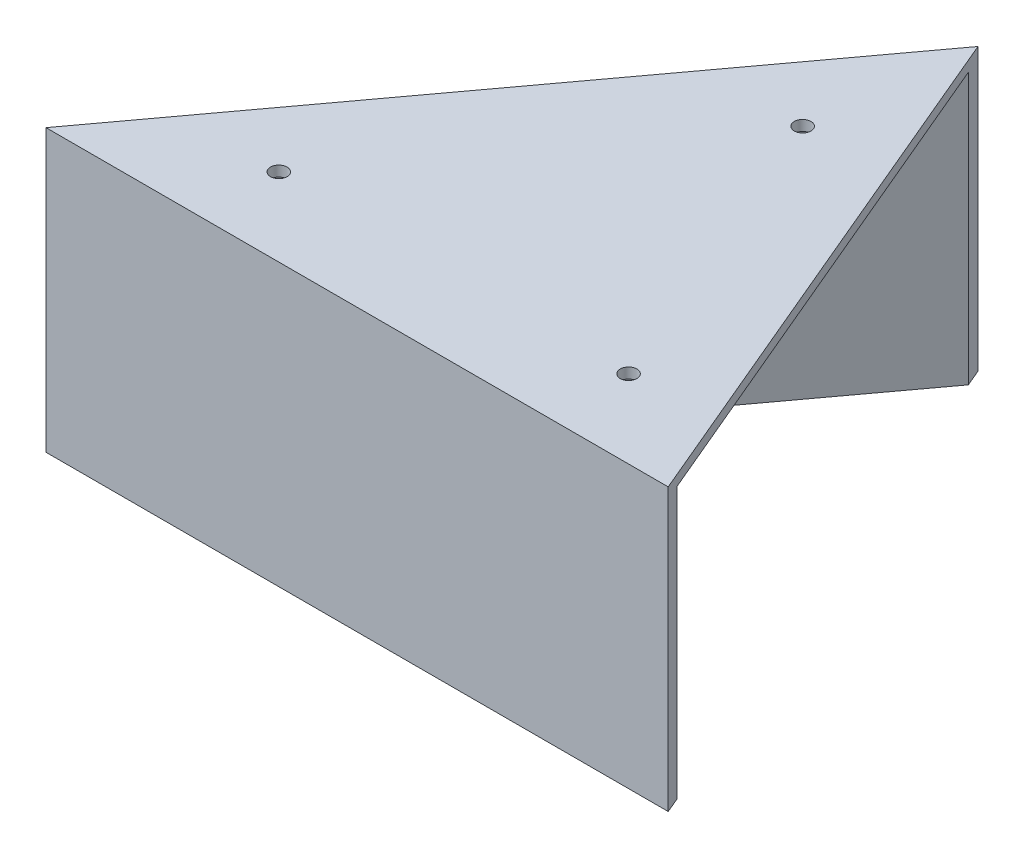
ISO-10303-21;
HEADER;
FILE_DESCRIPTION(('STEP AP214'),'2;1');
FILE_NAME('part.step','',(''),(''),'','','');
FILE_SCHEMA(('AUTOMOTIVE_DESIGN { 1 0 10303 214 1 1 1 1 }'));
ENDSEC;
DATA;
#1=APPLICATION_CONTEXT('core data for automotive mechanical design processes');
#2=APPLICATION_PROTOCOL_DEFINITION('international standard','automotive_design',2000,#1);
#3=PRODUCT_CONTEXT('',#1,'mechanical');
#4=PRODUCT('Part','Part','',(#3));
#5=PRODUCT_RELATED_PRODUCT_CATEGORY('part','',(#4));
#6=PRODUCT_DEFINITION_FORMATION('','',#4);
#7=PRODUCT_DEFINITION_CONTEXT('part definition',#1,'design');
#8=PRODUCT_DEFINITION('design','',#6,#7);
#9=PRODUCT_DEFINITION_SHAPE('','',#8);
#10=(LENGTH_UNIT() NAMED_UNIT(*) SI_UNIT(.MILLI.,.METRE.));
#11=(NAMED_UNIT(*) PLANE_ANGLE_UNIT() SI_UNIT($,.RADIAN.));
#12=(NAMED_UNIT(*) SI_UNIT($,.STERADIAN.) SOLID_ANGLE_UNIT());
#13=UNCERTAINTY_MEASURE_WITH_UNIT(LENGTH_MEASURE(1.E-05),#10,'distance_accuracy_value','');
#14=(GEOMETRIC_REPRESENTATION_CONTEXT(3) GLOBAL_UNCERTAINTY_ASSIGNED_CONTEXT((#13)) GLOBAL_UNIT_ASSIGNED_CONTEXT((#10,
#11,#12)) REPRESENTATION_CONTEXT('',''));
#15=CARTESIAN_POINT('',(0.,0.,0.));
#16=DIRECTION('',(0.,0.,1.));
#17=DIRECTION('',(1.,0.,0.));
#18=AXIS2_PLACEMENT_3D('',#15,#16,#17);
#19=CARTESIAN_POINT('',(6.5,2.,-103.));
#20=DIRECTION('',(-0.921213947184014,0.,0.389056375752472));
#21=DIRECTION('',(0.389056375752472,0.,0.921213947184014));
#22=AXIS2_PLACEMENT_3D('',#19,#20,#21);
#23=PLANE('',#22);
#24=DIRECTION('',(0.389056375752472,0.,0.921213947184014));
#25=VECTOR('',#24,1.);
#26=CARTESIAN_POINT('',(6.5,-52.,-103.));
#27=LINE('',#26,#25);
#28=CARTESIAN_POINT('',(48.7330097087379,-52.,-3.00000000000003));
#29=VERTEX_POINT('',#28);
#30=CARTESIAN_POINT('',(50.,-52.,0.));
#31=VERTEX_POINT('',#30);
#32=EDGE_CURVE('E89',#29,#31,#27,.T.);
#33=ORIENTED_EDGE('',*,*,#32,.F.);
#34=DIRECTION('',(0.,-1.,0.));
#35=VECTOR('',#34,1.);
#36=CARTESIAN_POINT('',(48.7330097087379,113.00308109224,-3.00000000000003));
#37=LINE('',#36,#35);
#38=CARTESIAN_POINT('',(48.7330097087379,0.,-3.00000000000003));
#39=VERTEX_POINT('',#38);
#40=EDGE_CURVE('E98',#39,#29,#37,.T.);
#41=ORIENTED_EDGE('',*,*,#40,.F.);
#42=DIRECTION('',(0.389056375752472,0.,0.921213947184014));
#43=VECTOR('',#42,1.);
#44=CARTESIAN_POINT('',(6.5,0.,-103.));
#45=LINE('',#44,#43);
#46=CARTESIAN_POINT('',(7.85715235470177,0.,-99.7865128153038));
#47=VERTEX_POINT('',#46);
#48=EDGE_CURVE('E102',#47,#39,#45,.T.);
#49=ORIENTED_EDGE('',*,*,#48,.F.);
#50=DIRECTION('',(0.,-1.,0.));
#51=VECTOR('',#50,1.);
#52=CARTESIAN_POINT('',(7.85715235470177,2.,-99.7865128153038));
#53=LINE('',#52,#51);
#54=CARTESIAN_POINT('',(7.8571523547018,-52.,-99.7865128153039));
#55=VERTEX_POINT('',#54);
#56=EDGE_CURVE('E131',#47,#55,#53,.T.);
#57=ORIENTED_EDGE('',*,*,#56,.T.);
#58=CARTESIAN_POINT('',(6.5,-52.,-103.));
#59=VERTEX_POINT('',#58);
#60=EDGE_CURVE('E106',#59,#55,#27,.T.);
#61=ORIENTED_EDGE('',*,*,#60,.F.);
#62=DIRECTION('',(0.,-1.,0.));
#63=VECTOR('',#62,1.);
#64=CARTESIAN_POINT('',(6.5,2.,-103.));
#65=LINE('',#64,#63);
#66=CARTESIAN_POINT('',(6.5,2.,-103.));
#67=VERTEX_POINT('',#66);
#68=EDGE_CURVE('E40',#67,#59,#65,.T.);
#69=ORIENTED_EDGE('',*,*,#68,.F.);
#70=DIRECTION('',(-0.389056375752472,0.,-0.921213947184014));
#71=VECTOR('',#70,1.);
#72=CARTESIAN_POINT('',(6.5,2.,-103.));
#73=LINE('',#72,#71);
#74=CARTESIAN_POINT('',(50.,2.,0.));
#75=VERTEX_POINT('',#74);
#76=EDGE_CURVE('E117',#75,#67,#73,.T.);
#77=ORIENTED_EDGE('',*,*,#76,.F.);
#78=DIRECTION('',(0.,-1.,0.));
#79=VECTOR('',#78,1.);
#80=CARTESIAN_POINT('',(50.,2.,0.));
#81=LINE('',#80,#79);
#82=EDGE_CURVE('E11',#75,#31,#81,.T.);
#83=ORIENTED_EDGE('',*,*,#82,.T.);
#84=EDGE_LOOP('',(#33,#41,#49,#57,#61,#69,#77,#83));
#85=FACE_BOUND('',#84,.T.);
#86=ADVANCED_FACE('F33',(#85),#23,.F.);
#87=CARTESIAN_POINT('',(6.5,2.,-103.));
#88=DIRECTION('',(0.804662944010431,0.,0.593731881017405));
#89=DIRECTION('',(0.593731881017405,0.,-0.804662944010431));
#90=AXIS2_PLACEMENT_3D('',#87,#88,#89);
#91=PLANE('',#90);
#92=ORIENTED_EDGE('',*,*,#68,.T.);
#93=DIRECTION('',(0.593731881017405,0.,-0.804662944010431));
#94=VECTOR('',#93,1.);
#95=CARTESIAN_POINT('',(-69.5,-52.,0.));
#96=LINE('',#95,#94);
#97=CARTESIAN_POINT('',(-69.5,-52.,0.));
#98=VERTEX_POINT('',#97);
#99=EDGE_CURVE('E113',#98,#59,#96,.T.);
#100=ORIENTED_EDGE('',*,*,#99,.F.);
#101=DIRECTION('',(0.,-1.,0.));
#102=VECTOR('',#101,1.);
#103=CARTESIAN_POINT('',(-69.5,2.,0.));
#104=LINE('',#103,#102);
#105=CARTESIAN_POINT('',(-69.5,2.,0.));
#106=VERTEX_POINT('',#105);
#107=EDGE_CURVE('E121',#106,#98,#104,.T.);
#108=ORIENTED_EDGE('',*,*,#107,.F.);
#109=DIRECTION('',(-0.593731881017405,0.,0.804662944010431));
#110=VECTOR('',#109,1.);
#111=CARTESIAN_POINT('',(6.5,2.,-103.));
#112=LINE('',#111,#110);
#113=EDGE_CURVE('E119',#67,#106,#112,.T.);
#114=ORIENTED_EDGE('',*,*,#113,.F.);
#115=EDGE_LOOP('',(#92,#100,#108,#114));
#116=FACE_BOUND('',#115,.T.);
#117=ADVANCED_FACE('F126',(#116),#91,.F.);
#118=CARTESIAN_POINT('',(0.,2.,0.));
#119=DIRECTION('',(0.,0.,-1.));
#120=DIRECTION('',(-1.,0.,0.));
#121=AXIS2_PLACEMENT_3D('',#118,#119,#120);
#122=PLANE('',#121);
#123=ORIENTED_EDGE('',*,*,#107,.T.);
#124=DIRECTION('',(-1.,0.,0.));
#125=VECTOR('',#124,1.);
#126=CARTESIAN_POINT('',(50.,-52.,0.));
#127=LINE('',#126,#125);
#128=EDGE_CURVE('E108',#31,#98,#127,.T.);
#129=ORIENTED_EDGE('',*,*,#128,.F.);
#130=ORIENTED_EDGE('',*,*,#82,.F.);
#131=DIRECTION('',(1.,0.,0.));
#132=VECTOR('',#131,1.);
#133=CARTESIAN_POINT('',(0.,2.,0.));
#134=LINE('',#133,#132);
#135=EDGE_CURVE('E55',#106,#75,#134,.T.);
#136=ORIENTED_EDGE('',*,*,#135,.F.);
#137=EDGE_LOOP('',(#123,#129,#130,#136));
#138=FACE_BOUND('',#137,.T.);
#139=ADVANCED_FACE('F171',(#138),#122,.F.);
#140=CARTESIAN_POINT('',(0.,2.,0.));
#141=DIRECTION('',(0.,-1.,0.));
#142=DIRECTION('',(0.,0.,-1.));
#143=AXIS2_PLACEMENT_3D('',#140,#141,#142);
#144=PLANE('',#143);
#145=CARTESIAN_POINT('',(-39.7906932732431,2.,-15.));
#146=DIRECTION('',(0.,-1.,0.));
#147=DIRECTION('',(0.,0.,-1.));
#148=AXIS2_PLACEMENT_3D('',#145,#146,#147);
#149=CIRCLE('',#148,1.6);
#150=CARTESIAN_POINT('',(-39.7906932732431,2.,-16.6));
#151=VERTEX_POINT('',#150);
#152=EDGE_CURVE('E151',#151,#151,#149,.T.);
#153=ORIENTED_EDGE('',*,*,#152,.T.);
#154=EDGE_LOOP('',(#153));
#155=FACE_BOUND('',#154,.T.);
#156=CARTESIAN_POINT('',(27.382186081769,2.,-15.));
#157=DIRECTION('',(0.,-1.,0.));
#158=DIRECTION('',(0.,0.,-1.));
#159=AXIS2_PLACEMENT_3D('',#156,#157,#158);
#160=CIRCLE('',#159,1.6);
#161=CARTESIAN_POINT('',(27.382186081769,2.,-16.6));
#162=VERTEX_POINT('',#161);
#163=EDGE_CURVE('E148',#162,#162,#160,.T.);
#164=ORIENTED_EDGE('',*,*,#163,.T.);
#165=EDGE_LOOP('',(#164));
#166=FACE_BOUND('',#165,.T.);
#167=CARTESIAN_POINT('',(2.93013376425414,2.,-72.8979629587134));
#168=DIRECTION('',(0.,-1.,0.));
#169=DIRECTION('',(0.,0.,-1.));
#170=AXIS2_PLACEMENT_3D('',#167,#168,#169);
#171=CIRCLE('',#170,1.6);
#172=CARTESIAN_POINT('',(2.93013376425414,2.,-74.4979629587134));
#173=VERTEX_POINT('',#172);
#174=EDGE_CURVE('E143',#173,#173,#171,.T.);
#175=ORIENTED_EDGE('',*,*,#174,.T.);
#176=EDGE_LOOP('',(#175));
#177=FACE_BOUND('',#176,.T.);
#178=ORIENTED_EDGE('',*,*,#135,.T.);
#179=ORIENTED_EDGE('',*,*,#76,.T.);
#180=ORIENTED_EDGE('',*,*,#113,.T.);
#181=EDGE_LOOP('',(#178,#179,#180));
#182=FACE_BOUND('',#181,.T.);
#183=ADVANCED_FACE('F165',(#155,#166,#177,#182),#144,.F.);
#184=CARTESIAN_POINT('',(0.,-52.,0.));
#185=DIRECTION('',(0.,-1.,0.));
#186=DIRECTION('',(0.,0.,-1.));
#187=AXIS2_PLACEMENT_3D('',#184,#185,#186);
#188=PLANE('',#187);
#189=DIRECTION('',(-1.,0.,0.));
#190=VECTOR('',#189,1.);
#191=CARTESIAN_POINT('',(45.4764372163538,-52.,-3.));
#192=LINE('',#191,#190);
#193=CARTESIAN_POINT('',(-63.5581386546486,-52.,-3.00000000000002));
#194=VERTEX_POINT('',#193);
#195=EDGE_CURVE('E84',#29,#194,#192,.T.);
#196=ORIENTED_EDGE('',*,*,#195,.F.);
#197=ORIENTED_EDGE('',*,*,#32,.T.);
#198=ORIENTED_EDGE('',*,*,#128,.T.);
#199=ORIENTED_EDGE('',*,*,#99,.T.);
#200=ORIENTED_EDGE('',*,*,#60,.T.);
#201=DIRECTION('',(0.593731881017405,0.,-0.804662944010431));
#202=VECTOR('',#201,1.);
#203=CARTESIAN_POINT('',(-63.5581386546486,-52.,-3.00000000000002));
#204=LINE('',#203,#202);
#205=EDGE_CURVE('E91',#194,#55,#204,.T.);
#206=ORIENTED_EDGE('',*,*,#205,.F.);
#207=EDGE_LOOP('',(#196,#197,#198,#199,#200,#206));
#208=FACE_BOUND('',#207,.T.);
#209=ADVANCED_FACE('F86',(#208),#188,.T.);
#210=CARTESIAN_POINT('',(-63.5581386546486,-52.,-3.00000000000002));
#211=DIRECTION('',(0.804662944010431,0.,0.593731881017405));
#212=DIRECTION('',(0.593731881017405,0.,-0.804662944010431));
#213=AXIS2_PLACEMENT_3D('',#210,#211,#212);
#214=PLANE('',#213);
#215=DIRECTION('',(0.593731881017405,0.,-0.804662944010431));
#216=VECTOR('',#215,1.);
#217=CARTESIAN_POINT('',(-63.5581386546486,0.,-3.00000000000002));
#218=LINE('',#217,#216);
#219=CARTESIAN_POINT('',(-63.5581386546486,0.,-3.00000000000002));
#220=VERTEX_POINT('',#219);
#221=EDGE_CURVE('E154',#220,#47,#218,.T.);
#222=ORIENTED_EDGE('',*,*,#221,.F.);
#223=DIRECTION('',(0.,1.,0.));
#224=VECTOR('',#223,1.);
#225=CARTESIAN_POINT('',(-63.5581386546486,-52.,-3.00000000000002));
#226=LINE('',#225,#224);
#227=EDGE_CURVE('E95',#194,#220,#226,.T.);
#228=ORIENTED_EDGE('',*,*,#227,.F.);
#229=ORIENTED_EDGE('',*,*,#205,.T.);
#230=ORIENTED_EDGE('',*,*,#56,.F.);
#231=EDGE_LOOP('',(#222,#228,#229,#230));
#232=FACE_BOUND('',#231,.T.);
#233=ADVANCED_FACE('F157',(#232),#214,.T.);
#234=CARTESIAN_POINT('',(45.4764372163538,-52.,-3.));
#235=DIRECTION('',(0.,0.,-1.));
#236=DIRECTION('',(-1.,0.,0.));
#237=AXIS2_PLACEMENT_3D('',#234,#235,#236);
#238=PLANE('',#237);
#239=DIRECTION('',(-1.,0.,0.));
#240=VECTOR('',#239,1.);
#241=CARTESIAN_POINT('',(45.4764372163538,0.,-3.));
#242=LINE('',#241,#240);
#243=EDGE_CURVE('E47',#39,#220,#242,.T.);
#244=ORIENTED_EDGE('',*,*,#243,.F.);
#245=ORIENTED_EDGE('',*,*,#40,.T.);
#246=ORIENTED_EDGE('',*,*,#195,.T.);
#247=ORIENTED_EDGE('',*,*,#227,.T.);
#248=EDGE_LOOP('',(#244,#245,#246,#247));
#249=FACE_BOUND('',#248,.T.);
#250=ADVANCED_FACE('F99',(#249),#238,.T.);
#251=CARTESIAN_POINT('',(0.,0.,0.));
#252=DIRECTION('',(0.,-1.,0.));
#253=DIRECTION('',(0.,0.,-1.));
#254=AXIS2_PLACEMENT_3D('',#251,#252,#253);
#255=PLANE('',#254);
#256=CARTESIAN_POINT('',(-39.7906932732431,0.,-15.));
#257=DIRECTION('',(0.,-1.,0.));
#258=DIRECTION('',(0.,0.,-1.));
#259=AXIS2_PLACEMENT_3D('',#256,#257,#258);
#260=CIRCLE('',#259,1.6);
#261=CARTESIAN_POINT('',(-39.7906932732431,0.,-16.6));
#262=VERTEX_POINT('',#261);
#263=EDGE_CURVE('E140',#262,#262,#260,.T.);
#264=ORIENTED_EDGE('',*,*,#263,.F.);
#265=EDGE_LOOP('',(#264));
#266=FACE_BOUND('',#265,.T.);
#267=CARTESIAN_POINT('',(27.382186081769,0.,-15.));
#268=DIRECTION('',(0.,-1.,0.));
#269=DIRECTION('',(0.,0.,-1.));
#270=AXIS2_PLACEMENT_3D('',#267,#268,#269);
#271=CIRCLE('',#270,1.6);
#272=CARTESIAN_POINT('',(27.382186081769,0.,-16.6));
#273=VERTEX_POINT('',#272);
#274=EDGE_CURVE('E136',#273,#273,#271,.T.);
#275=ORIENTED_EDGE('',*,*,#274,.F.);
#276=EDGE_LOOP('',(#275));
#277=FACE_BOUND('',#276,.T.);
#278=CARTESIAN_POINT('',(2.93013376425414,0.,-72.8979629587134));
#279=DIRECTION('',(0.,-1.,0.));
#280=DIRECTION('',(0.,0.,-1.));
#281=AXIS2_PLACEMENT_3D('',#278,#279,#280);
#282=CIRCLE('',#281,1.6);
#283=CARTESIAN_POINT('',(2.93013376425414,0.,-74.4979629587134));
#284=VERTEX_POINT('',#283);
#285=EDGE_CURVE('E133',#284,#284,#282,.T.);
#286=ORIENTED_EDGE('',*,*,#285,.F.);
#287=EDGE_LOOP('',(#286));
#288=FACE_BOUND('',#287,.T.);
#289=ORIENTED_EDGE('',*,*,#221,.T.);
#290=ORIENTED_EDGE('',*,*,#48,.T.);
#291=ORIENTED_EDGE('',*,*,#243,.T.);
#292=EDGE_LOOP('',(#289,#290,#291));
#293=FACE_BOUND('',#292,.T.);
#294=ADVANCED_FACE('F156',(#266,#277,#288,#293),#255,.T.);
#295=CARTESIAN_POINT('',(2.93013376425414,52.,-72.8979629587134));
#296=DIRECTION('',(0.,-1.,0.));
#297=DIRECTION('',(0.,0.,-1.));
#298=AXIS2_PLACEMENT_3D('',#295,#296,#297);
#299=CYLINDRICAL_SURFACE('',#298,1.6);
#300=ORIENTED_EDGE('',*,*,#285,.T.);
#301=EDGE_LOOP('',(#300));
#302=FACE_BOUND('',#301,.T.);
#303=ORIENTED_EDGE('',*,*,#174,.F.);
#304=EDGE_LOOP('',(#303));
#305=FACE_BOUND('',#304,.T.);
#306=ADVANCED_FACE('F179',(#302,#305),#299,.F.);
#307=CARTESIAN_POINT('',(27.382186081769,52.,-15.));
#308=DIRECTION('',(0.,-1.,0.));
#309=DIRECTION('',(0.,0.,-1.));
#310=AXIS2_PLACEMENT_3D('',#307,#308,#309);
#311=CYLINDRICAL_SURFACE('',#310,1.6);
#312=ORIENTED_EDGE('',*,*,#274,.T.);
#313=EDGE_LOOP('',(#312));
#314=FACE_BOUND('',#313,.T.);
#315=ORIENTED_EDGE('',*,*,#163,.F.);
#316=EDGE_LOOP('',(#315));
#317=FACE_BOUND('',#316,.T.);
#318=ADVANCED_FACE('F193',(#314,#317),#311,.F.);
#319=CARTESIAN_POINT('',(-39.7906932732431,52.,-15.));
#320=DIRECTION('',(0.,-1.,0.));
#321=DIRECTION('',(0.,0.,-1.));
#322=AXIS2_PLACEMENT_3D('',#319,#320,#321);
#323=CYLINDRICAL_SURFACE('',#322,1.6);
#324=ORIENTED_EDGE('',*,*,#263,.T.);
#325=EDGE_LOOP('',(#324));
#326=FACE_BOUND('',#325,.T.);
#327=ORIENTED_EDGE('',*,*,#152,.F.);
#328=EDGE_LOOP('',(#327));
#329=FACE_BOUND('',#328,.T.);
#330=ADVANCED_FACE('F199',(#326,#329),#323,.F.);
#331=CLOSED_SHELL('',(#86,#117,#139,#183,#209,#233,#250,#294,#306,#318,#330));
#332=MANIFOLD_SOLID_BREP('B2',#331);
#333=ADVANCED_BREP_SHAPE_REPRESENTATION('',(#18,#332),#14);
#334=SHAPE_DEFINITION_REPRESENTATION(#9,#333);
ENDSEC;
END-ISO-10303-21;
